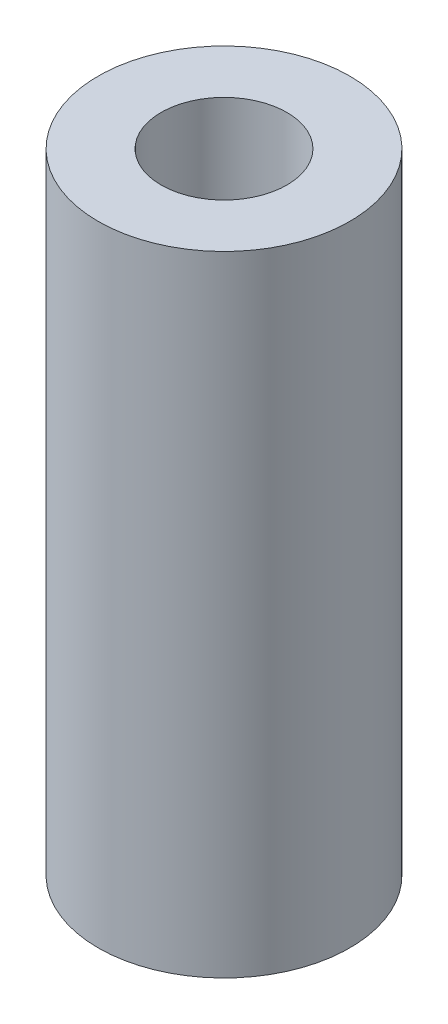
ISO-10303-21;
HEADER;
FILE_DESCRIPTION(('STEP AP214'),'2;1');
FILE_NAME('part.step','',(''),(''),'','','');
FILE_SCHEMA(('AUTOMOTIVE_DESIGN { 1 0 10303 214 1 1 1 1 }'));
ENDSEC;
DATA;
#1=APPLICATION_CONTEXT('core data for automotive mechanical design processes');
#2=APPLICATION_PROTOCOL_DEFINITION('international standard','automotive_design',2000,#1);
#3=PRODUCT_CONTEXT('',#1,'mechanical');
#4=PRODUCT('Part','Part','',(#3));
#5=PRODUCT_RELATED_PRODUCT_CATEGORY('part','',(#4));
#6=PRODUCT_DEFINITION_FORMATION('','',#4);
#7=PRODUCT_DEFINITION_CONTEXT('part definition',#1,'design');
#8=PRODUCT_DEFINITION('design','',#6,#7);
#9=PRODUCT_DEFINITION_SHAPE('','',#8);
#10=(LENGTH_UNIT() NAMED_UNIT(*) SI_UNIT(.MILLI.,.METRE.));
#11=(NAMED_UNIT(*) PLANE_ANGLE_UNIT() SI_UNIT($,.RADIAN.));
#12=(NAMED_UNIT(*) SI_UNIT($,.STERADIAN.) SOLID_ANGLE_UNIT());
#13=UNCERTAINTY_MEASURE_WITH_UNIT(LENGTH_MEASURE(1.E-05),#10,'distance_accuracy_value','');
#14=(GEOMETRIC_REPRESENTATION_CONTEXT(3) GLOBAL_UNCERTAINTY_ASSIGNED_CONTEXT((#13)) GLOBAL_UNIT_ASSIGNED_CONTEXT((#10,
#11,#12)) REPRESENTATION_CONTEXT('',''));
#15=CARTESIAN_POINT('',(0.,0.,0.));
#16=DIRECTION('',(0.,0.,1.));
#17=DIRECTION('',(1.,0.,0.));
#18=AXIS2_PLACEMENT_3D('',#15,#16,#17);
#19=CARTESIAN_POINT('',(0.,25.,0.));
#20=DIRECTION('',(0.,1.,0.));
#21=DIRECTION('',(0.,0.,1.));
#22=AXIS2_PLACEMENT_3D('',#19,#20,#21);
#23=PLANE('',#22);
#24=CARTESIAN_POINT('',(0.,25.,0.));
#25=DIRECTION('',(0.,1.,0.));
#26=DIRECTION('',(0.,0.,1.));
#27=AXIS2_PLACEMENT_3D('',#24,#25,#26);
#28=CIRCLE('',#27,5.);
#29=CARTESIAN_POINT('',(0.,25.,5.));
#30=VERTEX_POINT('',#29);
#31=EDGE_CURVE('E10',#30,#30,#28,.T.);
#32=ORIENTED_EDGE('',*,*,#31,.T.);
#33=EDGE_LOOP('',(#32));
#34=FACE_BOUND('',#33,.T.);
#35=CARTESIAN_POINT('',(0.,25.,0.));
#36=DIRECTION('',(0.,1.,0.));
#37=DIRECTION('',(0.,0.,1.));
#38=AXIS2_PLACEMENT_3D('',#35,#36,#37);
#39=CIRCLE('',#38,2.5);
#40=CARTESIAN_POINT('',(0.,25.,2.5));
#41=VERTEX_POINT('',#40);
#42=EDGE_CURVE('E43',#41,#41,#39,.T.);
#43=ORIENTED_EDGE('',*,*,#42,.F.);
#44=EDGE_LOOP('',(#43));
#45=FACE_BOUND('',#44,.T.);
#46=ADVANCED_FACE('F32',(#34,#45),#23,.T.);
#47=CARTESIAN_POINT('',(0.,0.,0.));
#48=DIRECTION('',(0.,1.,0.));
#49=DIRECTION('',(0.,0.,1.));
#50=AXIS2_PLACEMENT_3D('',#47,#48,#49);
#51=PLANE('',#50);
#52=CARTESIAN_POINT('',(0.,0.,0.));
#53=DIRECTION('',(0.,1.,0.));
#54=DIRECTION('',(0.,0.,1.));
#55=AXIS2_PLACEMENT_3D('',#52,#53,#54);
#56=CIRCLE('',#55,5.);
#57=CARTESIAN_POINT('',(0.,0.,5.));
#58=VERTEX_POINT('',#57);
#59=EDGE_CURVE('E36',#58,#58,#56,.T.);
#60=ORIENTED_EDGE('',*,*,#59,.F.);
#61=EDGE_LOOP('',(#60));
#62=FACE_BOUND('',#61,.T.);
#63=CARTESIAN_POINT('',(0.,0.,0.));
#64=DIRECTION('',(0.,1.,0.));
#65=DIRECTION('',(0.,0.,1.));
#66=AXIS2_PLACEMENT_3D('',#63,#64,#65);
#67=CIRCLE('',#66,2.5);
#68=CARTESIAN_POINT('',(0.,0.,2.5));
#69=VERTEX_POINT('',#68);
#70=EDGE_CURVE('E45',#69,#69,#67,.T.);
#71=ORIENTED_EDGE('',*,*,#70,.T.);
#72=EDGE_LOOP('',(#71));
#73=FACE_BOUND('',#72,.T.);
#74=ADVANCED_FACE('F55',(#62,#73),#51,.F.);
#75=CARTESIAN_POINT('',(0.,25.,0.));
#76=DIRECTION('',(0.,-1.,0.));
#77=DIRECTION('',(0.,0.,-1.));
#78=AXIS2_PLACEMENT_3D('',#75,#76,#77);
#79=CYLINDRICAL_SURFACE('',#78,5.);
#80=ORIENTED_EDGE('',*,*,#31,.F.);
#81=EDGE_LOOP('',(#80));
#82=FACE_BOUND('',#81,.T.);
#83=ORIENTED_EDGE('',*,*,#59,.T.);
#84=EDGE_LOOP('',(#83));
#85=FACE_BOUND('',#84,.T.);
#86=ADVANCED_FACE('F34',(#82,#85),#79,.T.);
#87=CARTESIAN_POINT('',(0.,25.,0.));
#88=DIRECTION('',(0.,-1.,0.));
#89=DIRECTION('',(0.,0.,-1.));
#90=AXIS2_PLACEMENT_3D('',#87,#88,#89);
#91=CYLINDRICAL_SURFACE('',#90,2.5);
#92=ORIENTED_EDGE('',*,*,#42,.T.);
#93=EDGE_LOOP('',(#92));
#94=FACE_BOUND('',#93,.T.);
#95=ORIENTED_EDGE('',*,*,#70,.F.);
#96=EDGE_LOOP('',(#95));
#97=FACE_BOUND('',#96,.T.);
#98=ADVANCED_FACE('F51',(#94,#97),#91,.F.);
#99=CLOSED_SHELL('',(#46,#74,#86,#98));
#100=MANIFOLD_SOLID_BREP('B2',#99);
#101=ADVANCED_BREP_SHAPE_REPRESENTATION('',(#18,#100),#14);
#102=SHAPE_DEFINITION_REPRESENTATION(#9,#101);
ENDSEC;
END-ISO-10303-21;
